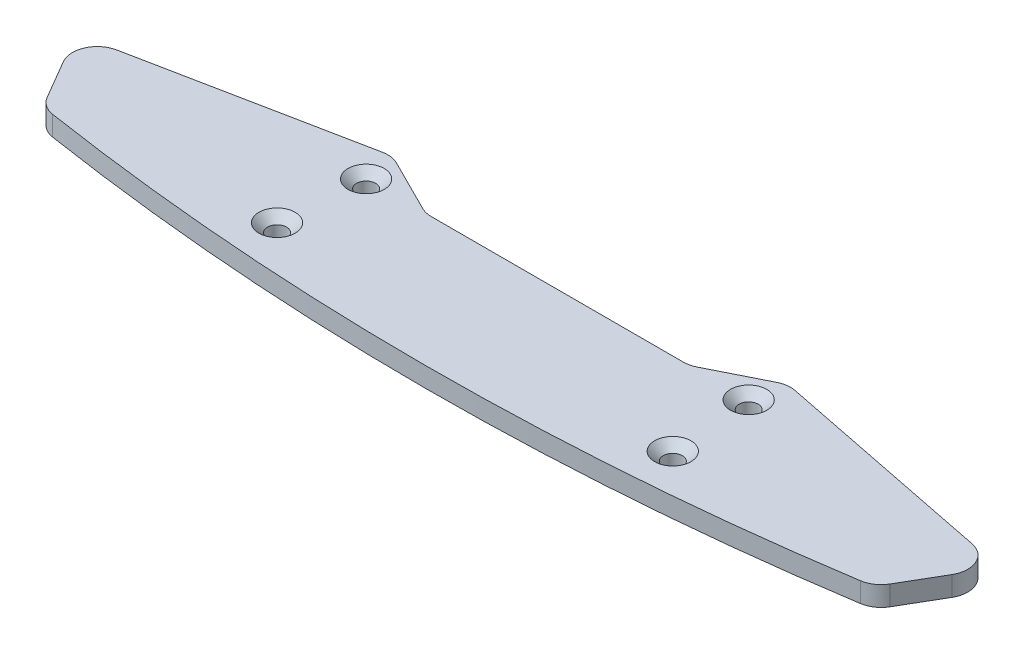
ISO-10303-21;
HEADER;
FILE_DESCRIPTION(('STEP AP214'),'2;1');
FILE_NAME('part.step','',(''),(''),'','','');
FILE_SCHEMA(('AUTOMOTIVE_DESIGN { 1 0 10303 214 1 1 1 1 }'));
ENDSEC;
DATA;
#1=APPLICATION_CONTEXT('core data for automotive mechanical design processes');
#2=APPLICATION_PROTOCOL_DEFINITION('international standard','automotive_design',2000,#1);
#3=PRODUCT_CONTEXT('',#1,'mechanical');
#4=PRODUCT('Part','Part','',(#3));
#5=PRODUCT_RELATED_PRODUCT_CATEGORY('part','',(#4));
#6=PRODUCT_DEFINITION_FORMATION('','',#4);
#7=PRODUCT_DEFINITION_CONTEXT('part definition',#1,'design');
#8=PRODUCT_DEFINITION('design','',#6,#7);
#9=PRODUCT_DEFINITION_SHAPE('','',#8);
#10=(LENGTH_UNIT() NAMED_UNIT(*) SI_UNIT(.MILLI.,.METRE.));
#11=(NAMED_UNIT(*) PLANE_ANGLE_UNIT() SI_UNIT($,.RADIAN.));
#12=(NAMED_UNIT(*) SI_UNIT($,.STERADIAN.) SOLID_ANGLE_UNIT());
#13=UNCERTAINTY_MEASURE_WITH_UNIT(LENGTH_MEASURE(1.E-05),#10,'distance_accuracy_value','');
#14=(GEOMETRIC_REPRESENTATION_CONTEXT(3) GLOBAL_UNCERTAINTY_ASSIGNED_CONTEXT((#13)) GLOBAL_UNIT_ASSIGNED_CONTEXT((#10,
#11,#12)) REPRESENTATION_CONTEXT('',''));
#15=CARTESIAN_POINT('',(0.,0.,0.));
#16=DIRECTION('',(0.,0.,1.));
#17=DIRECTION('',(1.,0.,0.));
#18=AXIS2_PLACEMENT_3D('',#15,#16,#17);
#19=CARTESIAN_POINT('',(0.,3.,0.));
#20=DIRECTION('',(0.,0.,1.));
#21=DIRECTION('',(1.,0.,0.));
#22=AXIS2_PLACEMENT_3D('',#19,#20,#21);
#23=PLANE('',#22);
#24=DIRECTION('',(-1.,0.,0.));
#25=VECTOR('',#24,1.);
#26=CARTESIAN_POINT('',(0.,3.,0.));
#27=LINE('',#26,#25);
#28=CARTESIAN_POINT('',(19.1147450843758,3.,0.));
#29=VERTEX_POINT('',#28);
#30=CARTESIAN_POINT('',(-19.1147450843758,3.,0.));
#31=VERTEX_POINT('',#30);
#32=EDGE_CURVE('E167',#29,#31,#27,.T.);
#33=ORIENTED_EDGE('',*,*,#32,.F.);
#34=DIRECTION('',(0.,-1.,0.));
#35=VECTOR('',#34,1.);
#36=CARTESIAN_POINT('',(19.1147450843758,0.,0.));
#37=LINE('',#36,#35);
#38=CARTESIAN_POINT('',(19.1147450843758,0.,0.));
#39=VERTEX_POINT('',#38);
#40=EDGE_CURVE('E152',#29,#39,#37,.T.);
#41=ORIENTED_EDGE('',*,*,#40,.T.);
#42=DIRECTION('',(-1.,0.,0.));
#43=VECTOR('',#42,1.);
#44=CARTESIAN_POINT('',(0.,0.,0.));
#45=LINE('',#44,#43);
#46=CARTESIAN_POINT('',(-19.1147450843758,0.,0.));
#47=VERTEX_POINT('',#46);
#48=EDGE_CURVE('E164',#39,#47,#45,.T.);
#49=ORIENTED_EDGE('',*,*,#48,.T.);
#50=DIRECTION('',(0.,-1.,0.));
#51=VECTOR('',#50,1.);
#52=CARTESIAN_POINT('',(-19.1147450843758,3.,0.));
#53=LINE('',#52,#51);
#54=EDGE_CURVE('E169',#47,#31,#53,.F.);
#55=ORIENTED_EDGE('',*,*,#54,.T.);
#56=EDGE_LOOP('',(#33,#41,#49,#55));
#57=FACE_BOUND('',#56,.T.);
#58=ADVANCED_FACE('F34',(#57),#23,.F.);
#59=CARTESIAN_POINT('',(0.,3.,-379.400000000001));
#60=DIRECTION('',(0.,-1.,0.));
#61=DIRECTION('',(0.,0.,-1.));
#62=AXIS2_PLACEMENT_3D('',#59,#60,#61);
#63=CYLINDRICAL_SURFACE('',#62,399.400000000001);
#64=CARTESIAN_POINT('',(0.,0.,-379.400000000001));
#65=DIRECTION('',(0.,1.,0.));
#66=DIRECTION('',(0.,0.,1.));
#67=AXIS2_PLACEMENT_3D('',#64,#65,#66);
#68=CIRCLE('',#67,399.400000000001);
#69=CARTESIAN_POINT('',(-61.2328777882055,0.,15.2782166243466));
#70=VERTEX_POINT('',#69);
#71=CARTESIAN_POINT('',(61.2328777882055,0.,15.2782166243468));
#72=VERTEX_POINT('',#71);
#73=EDGE_CURVE('E173',#70,#72,#68,.T.);
#74=ORIENTED_EDGE('',*,*,#73,.T.);
#75=DIRECTION('',(0.,-1.,0.));
#76=VECTOR('',#75,1.);
#77=CARTESIAN_POINT('',(61.2328777882055,3.,15.2782166243467));
#78=LINE('',#77,#76);
#79=CARTESIAN_POINT('',(61.2328777882055,3.,15.2782166243468));
#80=VERTEX_POINT('',#79);
#81=EDGE_CURVE('E231',#72,#80,#78,.F.);
#82=ORIENTED_EDGE('',*,*,#81,.T.);
#83=CARTESIAN_POINT('',(0.,3.,-379.400000000001));
#84=DIRECTION('',(0.,1.,0.));
#85=DIRECTION('',(0.,0.,1.));
#86=AXIS2_PLACEMENT_3D('',#83,#84,#85);
#87=CIRCLE('',#86,399.400000000001);
#88=CARTESIAN_POINT('',(-61.2328777882055,3.,15.2782166243466));
#89=VERTEX_POINT('',#88);
#90=EDGE_CURVE('E258',#89,#80,#87,.T.);
#91=ORIENTED_EDGE('',*,*,#90,.F.);
#92=DIRECTION('',(0.,-1.,0.));
#93=VECTOR('',#92,1.);
#94=CARTESIAN_POINT('',(-61.2328777882055,3.,15.2782166243468));
#95=LINE('',#94,#93);
#96=EDGE_CURVE('E228',#89,#70,#95,.T.);
#97=ORIENTED_EDGE('',*,*,#96,.T.);
#98=EDGE_LOOP('',(#74,#82,#91,#97));
#99=FACE_BOUND('',#98,.T.);
#100=ADVANCED_FACE('F342',(#99),#63,.T.);
#101=CARTESIAN_POINT('',(70.,3.,3.));
#102=DIRECTION('',(-0.863778900898433,0.,-0.503871025524086));
#103=DIRECTION('',(-0.503871025524087,0.,0.863778900898433));
#104=AXIS2_PLACEMENT_3D('',#101,#102,#103);
#105=PLANE('',#104);
#106=DIRECTION('',(0.503871025524087,0.,-0.863778900898433));
#107=VECTOR('',#106,1.);
#108=CARTESIAN_POINT('',(70.,0.,3.));
#109=LINE('',#108,#107);
#110=CARTESIAN_POINT('',(63.897128056395,0.,13.4620661890372));
#111=VERTEX_POINT('',#110);
#112=CARTESIAN_POINT('',(67.3536098778618,0.,7.53666878080844));
#113=VERTEX_POINT('',#112);
#114=EDGE_CURVE('E177',#111,#113,#109,.T.);
#115=ORIENTED_EDGE('',*,*,#114,.T.);
#116=DIRECTION('',(0.,-1.,0.));
#117=VECTOR('',#116,1.);
#118=CARTESIAN_POINT('',(67.3536098778618,3.,7.53666878080844));
#119=LINE('',#118,#117);
#120=CARTESIAN_POINT('',(67.3536098778618,3.,7.53666878080844));
#121=VERTEX_POINT('',#120);
#122=EDGE_CURVE('E49',#113,#121,#119,.F.);
#123=ORIENTED_EDGE('',*,*,#122,.T.);
#124=DIRECTION('',(0.503871025524087,0.,-0.863778900898433));
#125=VECTOR('',#124,1.);
#126=CARTESIAN_POINT('',(70.,3.,3.));
#127=LINE('',#126,#125);
#128=CARTESIAN_POINT('',(63.897128056395,3.,13.4620661890372));
#129=VERTEX_POINT('',#128);
#130=EDGE_CURVE('E256',#129,#121,#127,.T.);
#131=ORIENTED_EDGE('',*,*,#130,.F.);
#132=DIRECTION('',(0.,-1.,0.));
#133=VECTOR('',#132,1.);
#134=CARTESIAN_POINT('',(63.897128056395,3.,13.4620661890372));
#135=LINE('',#134,#133);
#136=EDGE_CURVE('E224',#129,#111,#135,.T.);
#137=ORIENTED_EDGE('',*,*,#136,.T.);
#138=EDGE_LOOP('',(#115,#123,#131,#137));
#139=FACE_BOUND('',#138,.T.);
#140=ADVANCED_FACE('F347',(#139),#105,.F.);
#141=CARTESIAN_POINT('',(30.,3.,-5.));
#142=DIRECTION('',(-0.196116135138184,0.,0.98058067569092));
#143=DIRECTION('',(0.98058067569092,0.,0.196116135138184));
#144=AXIS2_PLACEMENT_3D('',#141,#142,#143);
#145=PLANE('',#144);
#146=DIRECTION('',(-0.98058067569092,0.,-0.196116135138184));
#147=VECTOR('',#146,1.);
#148=CARTESIAN_POINT('',(30.,0.,-5.));
#149=LINE('',#148,#147);
#150=CARTESIAN_POINT('',(64.8498745062608,0.,1.96997490125216));
#151=VERTEX_POINT('',#150);
#152=CARTESIAN_POINT('',(31.2616681105075,0.,-4.7476663778985));
#153=VERTEX_POINT('',#152);
#154=EDGE_CURVE('E187',#151,#153,#149,.T.);
#155=ORIENTED_EDGE('',*,*,#154,.T.);
#156=DIRECTION('',(0.,-1.,0.));
#157=VECTOR('',#156,1.);
#158=CARTESIAN_POINT('',(31.2616681105075,3.,-4.7476663778985));
#159=LINE('',#158,#157);
#160=CARTESIAN_POINT('',(31.2616681105075,3.,-4.7476663778985));
#161=VERTEX_POINT('',#160);
#162=EDGE_CURVE('E211',#153,#161,#159,.F.);
#163=ORIENTED_EDGE('',*,*,#162,.T.);
#164=DIRECTION('',(-0.98058067569092,0.,-0.196116135138184));
#165=VECTOR('',#164,1.);
#166=CARTESIAN_POINT('',(30.,3.,-5.));
#167=LINE('',#166,#165);
#168=CARTESIAN_POINT('',(64.8498745062608,3.,1.96997490125216));
#169=VERTEX_POINT('',#168);
#170=EDGE_CURVE('E255',#169,#161,#167,.T.);
#171=ORIENTED_EDGE('',*,*,#170,.F.);
#172=DIRECTION('',(0.,-1.,0.));
#173=VECTOR('',#172,1.);
#174=CARTESIAN_POINT('',(64.8498745062608,3.,1.96997490125216));
#175=LINE('',#174,#173);
#176=EDGE_CURVE('E208',#169,#151,#175,.T.);
#177=ORIENTED_EDGE('',*,*,#176,.T.);
#178=EDGE_LOOP('',(#155,#163,#171,#177));
#179=FACE_BOUND('',#178,.T.);
#180=ADVANCED_FACE('F411',(#179),#145,.F.);
#181=CARTESIAN_POINT('',(20.,3.,0.));
#182=DIRECTION('',(0.447213595499958,0.,0.894427190999916));
#183=DIRECTION('',(0.894427190999916,0.,-0.447213595499958));
#184=AXIS2_PLACEMENT_3D('',#181,#182,#183);
#185=PLANE('',#184);
#186=DIRECTION('',(-0.894427190999916,0.,0.447213595499958));
#187=VECTOR('',#186,1.);
#188=CARTESIAN_POINT('',(20.,0.,0.));
#189=LINE('',#188,#187);
#190=CARTESIAN_POINT('',(28.8491816206145,0.,-4.42459081030723));
#191=VERTEX_POINT('',#190);
#192=CARTESIAN_POINT('',(20.7917960675006,0.,-0.395898033750313));
#193=VERTEX_POINT('',#192);
#194=EDGE_CURVE('E190',#191,#193,#189,.T.);
#195=ORIENTED_EDGE('',*,*,#194,.T.);
#196=DIRECTION('',(0.,-1.,0.));
#197=VECTOR('',#196,1.);
#198=CARTESIAN_POINT('',(20.7917960675006,3.,-0.395898033750313));
#199=LINE('',#198,#197);
#200=CARTESIAN_POINT('',(20.7917960675006,3.,-0.395898033750313));
#201=VERTEX_POINT('',#200);
#202=EDGE_CURVE('E153',#193,#201,#199,.F.);
#203=ORIENTED_EDGE('',*,*,#202,.T.);
#204=DIRECTION('',(-0.894427190999916,0.,0.447213595499958));
#205=VECTOR('',#204,1.);
#206=CARTESIAN_POINT('',(20.,3.,0.));
#207=LINE('',#206,#205);
#208=CARTESIAN_POINT('',(28.8491816206145,3.,-4.42459081030723));
#209=VERTEX_POINT('',#208);
#210=EDGE_CURVE('E183',#209,#201,#207,.T.);
#211=ORIENTED_EDGE('',*,*,#210,.F.);
#212=DIRECTION('',(0.,-1.,0.));
#213=VECTOR('',#212,1.);
#214=CARTESIAN_POINT('',(28.8491816206145,3.,-4.42459081030723));
#215=LINE('',#214,#213);
#216=EDGE_CURVE('E168',#209,#191,#215,.T.);
#217=ORIENTED_EDGE('',*,*,#216,.T.);
#218=EDGE_LOOP('',(#195,#203,#211,#217));
#219=FACE_BOUND('',#218,.T.);
#220=ADVANCED_FACE('F317',(#219),#185,.F.);
#221=CARTESIAN_POINT('',(0.,3.,-379.400000000001));
#222=DIRECTION('',(0.,1.,0.));
#223=DIRECTION('',(0.,0.,1.));
#224=AXIS2_PLACEMENT_3D('',#221,#222,#223);
#225=PLANE('',#224);
#226=CARTESIAN_POINT('',(-29.,3.,0.));
#227=DIRECTION('',(0.,1.,0.));
#228=DIRECTION('',(0.,0.,1.));
#229=AXIS2_PLACEMENT_3D('',#226,#227,#228);
#230=CIRCLE('',#229,2.75);
#231=CARTESIAN_POINT('',(-29.,3.,2.75));
#232=VERTEX_POINT('',#231);
#233=EDGE_CURVE('E309',#232,#232,#230,.T.);
#234=ORIENTED_EDGE('',*,*,#233,.F.);
#235=EDGE_LOOP('',(#234));
#236=FACE_BOUND('',#235,.T.);
#237=CARTESIAN_POINT('',(-30.,3.,12.5));
#238=DIRECTION('',(0.,1.,0.));
#239=DIRECTION('',(0.,0.,1.));
#240=AXIS2_PLACEMENT_3D('',#237,#238,#239);
#241=CIRCLE('',#240,2.75);
#242=CARTESIAN_POINT('',(-30.,3.,15.25));
#243=VERTEX_POINT('',#242);
#244=EDGE_CURVE('E300',#243,#243,#241,.T.);
#245=ORIENTED_EDGE('',*,*,#244,.F.);
#246=EDGE_LOOP('',(#245));
#247=FACE_BOUND('',#246,.T.);
#248=CARTESIAN_POINT('',(29.,3.,0.));
#249=DIRECTION('',(0.,1.,0.));
#250=DIRECTION('',(0.,0.,1.));
#251=AXIS2_PLACEMENT_3D('',#248,#249,#250);
#252=CIRCLE('',#251,2.75);
#253=CARTESIAN_POINT('',(29.,3.,2.75));
#254=VERTEX_POINT('',#253);
#255=EDGE_CURVE('E274',#254,#254,#252,.T.);
#256=ORIENTED_EDGE('',*,*,#255,.F.);
#257=EDGE_LOOP('',(#256));
#258=FACE_BOUND('',#257,.T.);
#259=CARTESIAN_POINT('',(30.,3.,12.5));
#260=DIRECTION('',(0.,1.,0.));
#261=DIRECTION('',(0.,0.,1.));
#262=AXIS2_PLACEMENT_3D('',#259,#260,#261);
#263=CIRCLE('',#262,2.75);
#264=CARTESIAN_POINT('',(30.,3.,15.25));
#265=VERTEX_POINT('',#264);
#266=EDGE_CURVE('E265',#265,#265,#263,.T.);
#267=ORIENTED_EDGE('',*,*,#266,.F.);
#268=EDGE_LOOP('',(#267));
#269=FACE_BOUND('',#268,.T.);
#270=ORIENTED_EDGE('',*,*,#170,.T.);
#271=CARTESIAN_POINT('',(30.5262326037393,3.,-1.07048884405755));
#272=DIRECTION('',(0.,1.,0.));
#273=DIRECTION('',(0.,0.,1.));
#274=AXIS2_PLACEMENT_3D('',#271,#272,#273);
#275=CIRCLE('',#274,3.75);
#276=EDGE_CURVE('E222',#161,#209,#275,.T.);
#277=ORIENTED_EDGE('',*,*,#276,.T.);
#278=ORIENTED_EDGE('',*,*,#210,.T.);
#279=CARTESIAN_POINT('',(19.1147450843758,3.,-3.75));
#280=DIRECTION('',(0.,1.,0.));
#281=DIRECTION('',(0.,0.,1.));
#282=AXIS2_PLACEMENT_3D('',#279,#280,#281);
#283=CIRCLE('',#282,3.75);
#284=EDGE_CURVE('E158',#201,#29,#283,.F.);
#285=ORIENTED_EDGE('',*,*,#284,.T.);
#286=ORIENTED_EDGE('',*,*,#32,.T.);
#287=CARTESIAN_POINT('',(-19.1147450843758,3.,-3.75));
#288=DIRECTION('',(0.,1.,0.));
#289=DIRECTION('',(0.,0.,1.));
#290=AXIS2_PLACEMENT_3D('',#287,#288,#289);
#291=CIRCLE('',#290,3.75);
#292=CARTESIAN_POINT('',(-20.7917960675006,3.,-0.395898033750315));
#293=VERTEX_POINT('',#292);
#294=EDGE_CURVE('E11',#31,#293,#291,.F.);
#295=ORIENTED_EDGE('',*,*,#294,.T.);
#296=DIRECTION('',(0.894427190999916,0.,0.447213595499958));
#297=VECTOR('',#296,1.);
#298=CARTESIAN_POINT('',(-20.,3.,0.));
#299=LINE('',#298,#297);
#300=CARTESIAN_POINT('',(-28.8491816206145,3.,-4.42459081030723));
#301=VERTEX_POINT('',#300);
#302=EDGE_CURVE('E281',#301,#293,#299,.T.);
#303=ORIENTED_EDGE('',*,*,#302,.F.);
#304=CARTESIAN_POINT('',(-30.5262326037393,3.,-1.07048884405755));
#305=DIRECTION('',(0.,1.,0.));
#306=DIRECTION('',(0.,0.,1.));
#307=AXIS2_PLACEMENT_3D('',#304,#305,#306);
#308=CIRCLE('',#307,3.75);
#309=CARTESIAN_POINT('',(-31.2616681105075,3.,-4.7476663778985));
#310=VERTEX_POINT('',#309);
#311=EDGE_CURVE('E215',#301,#310,#308,.T.);
#312=ORIENTED_EDGE('',*,*,#311,.T.);
#313=DIRECTION('',(0.98058067569092,0.,-0.196116135138184));
#314=VECTOR('',#313,1.);
#315=CARTESIAN_POINT('',(-30.,3.,-5.));
#316=LINE('',#315,#314);
#317=CARTESIAN_POINT('',(-64.8498745062608,3.,1.96997490125216));
#318=VERTEX_POINT('',#317);
#319=EDGE_CURVE('E290',#318,#310,#316,.T.);
#320=ORIENTED_EDGE('',*,*,#319,.F.);
#321=CARTESIAN_POINT('',(-64.1144389994926,3.,5.64715243509311));
#322=DIRECTION('',(0.,1.,0.));
#323=DIRECTION('',(0.,0.,1.));
#324=AXIS2_PLACEMENT_3D('',#321,#322,#323);
#325=CIRCLE('',#324,3.75);
#326=CARTESIAN_POINT('',(-67.3536098778618,3.,7.53666878080844));
#327=VERTEX_POINT('',#326);
#328=EDGE_CURVE('E217',#318,#327,#325,.T.);
#329=ORIENTED_EDGE('',*,*,#328,.T.);
#330=DIRECTION('',(-0.503871025524087,0.,-0.863778900898433));
#331=VECTOR('',#330,1.);
#332=CARTESIAN_POINT('',(-70.,3.,3.));
#333=LINE('',#332,#331);
#334=CARTESIAN_POINT('',(-63.8971280563949,3.,13.4620661890372));
#335=VERTEX_POINT('',#334);
#336=EDGE_CURVE('E277',#335,#327,#333,.T.);
#337=ORIENTED_EDGE('',*,*,#336,.F.);
#338=CARTESIAN_POINT('',(-60.6579571780258,3.,11.5725498433219));
#339=DIRECTION('',(0.,1.,0.));
#340=DIRECTION('',(0.,0.,1.));
#341=AXIS2_PLACEMENT_3D('',#338,#339,#340);
#342=CIRCLE('',#341,3.75);
#343=EDGE_CURVE('E213',#335,#89,#342,.T.);
#344=ORIENTED_EDGE('',*,*,#343,.T.);
#345=ORIENTED_EDGE('',*,*,#90,.T.);
#346=CARTESIAN_POINT('',(60.6579571780258,3.,11.5725498433218));
#347=DIRECTION('',(0.,1.,0.));
#348=DIRECTION('',(0.,0.,1.));
#349=AXIS2_PLACEMENT_3D('',#346,#347,#348);
#350=CIRCLE('',#349,3.75);
#351=EDGE_CURVE('E56',#80,#129,#350,.T.);
#352=ORIENTED_EDGE('',*,*,#351,.T.);
#353=ORIENTED_EDGE('',*,*,#130,.T.);
#354=CARTESIAN_POINT('',(64.1144389994926,3.,5.64715243509311));
#355=DIRECTION('',(0.,1.,0.));
#356=DIRECTION('',(0.,0.,1.));
#357=AXIS2_PLACEMENT_3D('',#354,#355,#356);
#358=CIRCLE('',#357,3.75);
#359=EDGE_CURVE('E220',#121,#169,#358,.T.);
#360=ORIENTED_EDGE('',*,*,#359,.T.);
#361=EDGE_LOOP('',(#270,#277,#278,#285,#286,#295,#303,#312,#320,#329,#337,#344,#345,#352,#353,#360));
#362=FACE_BOUND('',#361,.T.);
#363=ADVANCED_FACE('F249',(#236,#247,#258,#269,#362),#225,.T.);
#364=CARTESIAN_POINT('',(0.,0.,-379.400000000001));
#365=DIRECTION('',(0.,1.,0.));
#366=DIRECTION('',(0.,0.,1.));
#367=AXIS2_PLACEMENT_3D('',#364,#365,#366);
#368=PLANE('',#367);
#369=CARTESIAN_POINT('',(-29.,0.,0.));
#370=DIRECTION('',(0.,1.,0.));
#371=DIRECTION('',(0.,0.,1.));
#372=AXIS2_PLACEMENT_3D('',#369,#370,#371);
#373=CIRCLE('',#372,1.45);
#374=CARTESIAN_POINT('',(-29.,0.,1.45));
#375=VERTEX_POINT('',#374);
#376=EDGE_CURVE('E303',#375,#375,#373,.T.);
#377=ORIENTED_EDGE('',*,*,#376,.T.);
#378=EDGE_LOOP('',(#377));
#379=FACE_BOUND('',#378,.T.);
#380=CARTESIAN_POINT('',(-30.,0.,12.5));
#381=DIRECTION('',(0.,1.,0.));
#382=DIRECTION('',(0.,0.,1.));
#383=AXIS2_PLACEMENT_3D('',#380,#381,#382);
#384=CIRCLE('',#383,1.45);
#385=CARTESIAN_POINT('',(-30.,0.,13.95));
#386=VERTEX_POINT('',#385);
#387=EDGE_CURVE('E287',#386,#386,#384,.T.);
#388=ORIENTED_EDGE('',*,*,#387,.T.);
#389=EDGE_LOOP('',(#388));
#390=FACE_BOUND('',#389,.T.);
#391=CARTESIAN_POINT('',(29.,0.,0.));
#392=DIRECTION('',(0.,1.,0.));
#393=DIRECTION('',(0.,0.,1.));
#394=AXIS2_PLACEMENT_3D('',#391,#392,#393);
#395=CIRCLE('',#394,1.45);
#396=CARTESIAN_POINT('',(29.,0.,1.45));
#397=VERTEX_POINT('',#396);
#398=EDGE_CURVE('E268',#397,#397,#395,.T.);
#399=ORIENTED_EDGE('',*,*,#398,.T.);
#400=EDGE_LOOP('',(#399));
#401=FACE_BOUND('',#400,.T.);
#402=CARTESIAN_POINT('',(30.,0.,12.5));
#403=DIRECTION('',(0.,1.,0.));
#404=DIRECTION('',(0.,0.,1.));
#405=AXIS2_PLACEMENT_3D('',#402,#403,#404);
#406=CIRCLE('',#405,1.45);
#407=CARTESIAN_POINT('',(30.,0.,13.95));
#408=VERTEX_POINT('',#407);
#409=EDGE_CURVE('E174',#408,#408,#406,.T.);
#410=ORIENTED_EDGE('',*,*,#409,.T.);
#411=EDGE_LOOP('',(#410));
#412=FACE_BOUND('',#411,.T.);
#413=ORIENTED_EDGE('',*,*,#194,.F.);
#414=CARTESIAN_POINT('',(30.5262326037393,0.,-1.07048884405755));
#415=DIRECTION('',(0.,1.,0.));
#416=DIRECTION('',(0.,0.,1.));
#417=AXIS2_PLACEMENT_3D('',#414,#415,#416);
#418=CIRCLE('',#417,3.75);
#419=EDGE_CURVE('E206',#191,#153,#418,.F.);
#420=ORIENTED_EDGE('',*,*,#419,.T.);
#421=ORIENTED_EDGE('',*,*,#154,.F.);
#422=CARTESIAN_POINT('',(64.1144389994926,0.,5.64715243509311));
#423=DIRECTION('',(0.,1.,0.));
#424=DIRECTION('',(0.,0.,1.));
#425=AXIS2_PLACEMENT_3D('',#422,#423,#424);
#426=CIRCLE('',#425,3.75);
#427=EDGE_CURVE('E204',#151,#113,#426,.F.);
#428=ORIENTED_EDGE('',*,*,#427,.T.);
#429=ORIENTED_EDGE('',*,*,#114,.F.);
#430=CARTESIAN_POINT('',(60.6579571780258,0.,11.5725498433218));
#431=DIRECTION('',(0.,1.,0.));
#432=DIRECTION('',(0.,0.,1.));
#433=AXIS2_PLACEMENT_3D('',#430,#431,#432);
#434=CIRCLE('',#433,3.75);
#435=EDGE_CURVE('E202',#111,#72,#434,.F.);
#436=ORIENTED_EDGE('',*,*,#435,.T.);
#437=ORIENTED_EDGE('',*,*,#73,.F.);
#438=CARTESIAN_POINT('',(-60.6579571780258,0.,11.5725498433219));
#439=DIRECTION('',(0.,1.,0.));
#440=DIRECTION('',(0.,0.,1.));
#441=AXIS2_PLACEMENT_3D('',#438,#439,#440);
#442=CIRCLE('',#441,3.75);
#443=CARTESIAN_POINT('',(-63.8971280563949,0.,13.4620661890372));
#444=VERTEX_POINT('',#443);
#445=EDGE_CURVE('E196',#70,#444,#442,.F.);
#446=ORIENTED_EDGE('',*,*,#445,.T.);
#447=DIRECTION('',(-0.503871025524087,0.,-0.863778900898433));
#448=VECTOR('',#447,1.);
#449=CARTESIAN_POINT('',(-70.,0.,3.));
#450=LINE('',#449,#448);
#451=CARTESIAN_POINT('',(-67.3536098778618,0.,7.53666878080844));
#452=VERTEX_POINT('',#451);
#453=EDGE_CURVE('E278',#444,#452,#450,.T.);
#454=ORIENTED_EDGE('',*,*,#453,.T.);
#455=CARTESIAN_POINT('',(-64.1144389994926,0.,5.64715243509311));
#456=DIRECTION('',(0.,1.,0.));
#457=DIRECTION('',(0.,0.,1.));
#458=AXIS2_PLACEMENT_3D('',#455,#456,#457);
#459=CIRCLE('',#458,3.75);
#460=CARTESIAN_POINT('',(-64.8498745062608,0.,1.96997490125216));
#461=VERTEX_POINT('',#460);
#462=EDGE_CURVE('E200',#452,#461,#459,.F.);
#463=ORIENTED_EDGE('',*,*,#462,.T.);
#464=DIRECTION('',(0.98058067569092,0.,-0.196116135138184));
#465=VECTOR('',#464,1.);
#466=CARTESIAN_POINT('',(-30.,0.,-5.));
#467=LINE('',#466,#465);
#468=CARTESIAN_POINT('',(-31.2616681105075,0.,-4.7476663778985));
#469=VERTEX_POINT('',#468);
#470=EDGE_CURVE('E282',#461,#469,#467,.T.);
#471=ORIENTED_EDGE('',*,*,#470,.T.);
#472=CARTESIAN_POINT('',(-30.5262326037393,0.,-1.07048884405755));
#473=DIRECTION('',(0.,1.,0.));
#474=DIRECTION('',(0.,0.,1.));
#475=AXIS2_PLACEMENT_3D('',#472,#473,#474);
#476=CIRCLE('',#475,3.75);
#477=CARTESIAN_POINT('',(-28.8491816206145,0.,-4.42459081030723));
#478=VERTEX_POINT('',#477);
#479=EDGE_CURVE('E198',#469,#478,#476,.F.);
#480=ORIENTED_EDGE('',*,*,#479,.T.);
#481=DIRECTION('',(0.894427190999916,0.,0.447213595499958));
#482=VECTOR('',#481,1.);
#483=CARTESIAN_POINT('',(-20.,0.,0.));
#484=LINE('',#483,#482);
#485=CARTESIAN_POINT('',(-20.7917960675006,0.,-0.395898033750315));
#486=VERTEX_POINT('',#485);
#487=EDGE_CURVE('E285',#478,#486,#484,.T.);
#488=ORIENTED_EDGE('',*,*,#487,.T.);
#489=CARTESIAN_POINT('',(-19.1147450843758,0.,-3.75));
#490=DIRECTION('',(0.,1.,0.));
#491=DIRECTION('',(0.,0.,1.));
#492=AXIS2_PLACEMENT_3D('',#489,#490,#491);
#493=CIRCLE('',#492,3.75);
#494=EDGE_CURVE('E42',#486,#47,#493,.T.);
#495=ORIENTED_EDGE('',*,*,#494,.T.);
#496=ORIENTED_EDGE('',*,*,#48,.F.);
#497=CARTESIAN_POINT('',(19.1147450843758,0.,-3.75));
#498=DIRECTION('',(0.,1.,0.));
#499=DIRECTION('',(0.,0.,1.));
#500=AXIS2_PLACEMENT_3D('',#497,#498,#499);
#501=CIRCLE('',#500,3.75);
#502=EDGE_CURVE('E148',#39,#193,#501,.T.);
#503=ORIENTED_EDGE('',*,*,#502,.T.);
#504=EDGE_LOOP('',(#413,#420,#421,#428,#429,#436,#437,#446,#454,#463,#471,#480,#488,#495,#496,#503));
#505=FACE_BOUND('',#504,.T.);
#506=ADVANCED_FACE('F171',(#379,#390,#401,#412,#505),#368,.F.);
#507=CARTESIAN_POINT('',(30.,3.,12.5));
#508=DIRECTION('',(0.,1.,0.));
#509=DIRECTION('',(0.,0.,1.));
#510=AXIS2_PLACEMENT_3D('',#507,#508,#509);
#511=CYLINDRICAL_SURFACE('',#510,1.44999999999999);
#512=ORIENTED_EDGE('',*,*,#409,.F.);
#513=EDGE_LOOP('',(#512));
#514=FACE_BOUND('',#513,.T.);
#515=CARTESIAN_POINT('',(30.,1.69999999999999,12.5));
#516=DIRECTION('',(0.,1.,0.));
#517=DIRECTION('',(0.,0.,1.));
#518=AXIS2_PLACEMENT_3D('',#515,#516,#517);
#519=CIRCLE('',#518,1.44999999999999);
#520=CARTESIAN_POINT('',(30.,1.69999999999999,13.95));
#521=VERTEX_POINT('',#520);
#522=EDGE_CURVE('E180',#521,#521,#519,.T.);
#523=ORIENTED_EDGE('',*,*,#522,.T.);
#524=EDGE_LOOP('',(#523));
#525=FACE_BOUND('',#524,.T.);
#526=ADVANCED_FACE('F328',(#514,#525),#511,.F.);
#527=CARTESIAN_POINT('',(30.,3.,12.5));
#528=DIRECTION('',(0.,1.,0.));
#529=DIRECTION('',(0.,0.,1.));
#530=AXIS2_PLACEMENT_3D('',#527,#528,#529);
#531=CONICAL_SURFACE('',#530,2.75,0.78539816339745);
#532=ORIENTED_EDGE('',*,*,#522,.F.);
#533=EDGE_LOOP('',(#532));
#534=FACE_BOUND('',#533,.T.);
#535=ORIENTED_EDGE('',*,*,#266,.T.);
#536=EDGE_LOOP('',(#535));
#537=FACE_BOUND('',#536,.T.);
#538=ADVANCED_FACE('F325',(#534,#537),#531,.F.);
#539=CARTESIAN_POINT('',(29.,3.,0.));
#540=DIRECTION('',(0.,1.,0.));
#541=DIRECTION('',(0.,0.,1.));
#542=AXIS2_PLACEMENT_3D('',#539,#540,#541);
#543=CYLINDRICAL_SURFACE('',#542,1.44999999999999);
#544=ORIENTED_EDGE('',*,*,#398,.F.);
#545=EDGE_LOOP('',(#544));
#546=FACE_BOUND('',#545,.T.);
#547=CARTESIAN_POINT('',(29.,1.69999999999999,0.));
#548=DIRECTION('',(0.,1.,0.));
#549=DIRECTION('',(0.,0.,1.));
#550=AXIS2_PLACEMENT_3D('',#547,#548,#549);
#551=CIRCLE('',#550,1.44999999999999);
#552=CARTESIAN_POINT('',(29.,1.69999999999999,1.44999999999999));
#553=VERTEX_POINT('',#552);
#554=EDGE_CURVE('E271',#553,#553,#551,.T.);
#555=ORIENTED_EDGE('',*,*,#554,.T.);
#556=EDGE_LOOP('',(#555));
#557=FACE_BOUND('',#556,.T.);
#558=ADVANCED_FACE('F327',(#546,#557),#543,.F.);
#559=CARTESIAN_POINT('',(29.,3.,0.));
#560=DIRECTION('',(0.,1.,0.));
#561=DIRECTION('',(0.,0.,1.));
#562=AXIS2_PLACEMENT_3D('',#559,#560,#561);
#563=CONICAL_SURFACE('',#562,2.75,0.78539816339745);
#564=ORIENTED_EDGE('',*,*,#554,.F.);
#565=EDGE_LOOP('',(#564));
#566=FACE_BOUND('',#565,.T.);
#567=ORIENTED_EDGE('',*,*,#255,.T.);
#568=EDGE_LOOP('',(#567));
#569=FACE_BOUND('',#568,.T.);
#570=ADVANCED_FACE('F335',(#566,#569),#563,.F.);
#571=CARTESIAN_POINT('',(-20.,3.,0.));
#572=DIRECTION('',(0.447213595499958,0.,-0.894427190999916));
#573=DIRECTION('',(-0.894427190999916,0.,-0.447213595499958));
#574=AXIS2_PLACEMENT_3D('',#571,#572,#573);
#575=PLANE('',#574);
#576=ORIENTED_EDGE('',*,*,#487,.F.);
#577=DIRECTION('',(0.,-1.,0.));
#578=VECTOR('',#577,1.);
#579=CARTESIAN_POINT('',(-28.8491816206145,3.,-4.42459081030723));
#580=LINE('',#579,#578);
#581=EDGE_CURVE('E159',#478,#301,#580,.F.);
#582=ORIENTED_EDGE('',*,*,#581,.T.);
#583=ORIENTED_EDGE('',*,*,#302,.T.);
#584=DIRECTION('',(0.,-1.,0.));
#585=VECTOR('',#584,1.);
#586=CARTESIAN_POINT('',(-20.7917960675006,3.,-0.395898033750315));
#587=LINE('',#586,#585);
#588=EDGE_CURVE('E243',#293,#486,#587,.T.);
#589=ORIENTED_EDGE('',*,*,#588,.T.);
#590=EDGE_LOOP('',(#576,#582,#583,#589));
#591=FACE_BOUND('',#590,.T.);
#592=ADVANCED_FACE('F385',(#591),#575,.T.);
#593=CARTESIAN_POINT('',(-30.,3.,-5.));
#594=DIRECTION('',(-0.196116135138184,0.,-0.98058067569092));
#595=DIRECTION('',(-0.98058067569092,0.,0.196116135138184));
#596=AXIS2_PLACEMENT_3D('',#593,#594,#595);
#597=PLANE('',#596);
#598=ORIENTED_EDGE('',*,*,#470,.F.);
#599=DIRECTION('',(0.,-1.,0.));
#600=VECTOR('',#599,1.);
#601=CARTESIAN_POINT('',(-64.8498745062608,3.,1.96997490125216));
#602=LINE('',#601,#600);
#603=EDGE_CURVE('E241',#461,#318,#602,.F.);
#604=ORIENTED_EDGE('',*,*,#603,.T.);
#605=ORIENTED_EDGE('',*,*,#319,.T.);
#606=DIRECTION('',(0.,-1.,0.));
#607=VECTOR('',#606,1.);
#608=CARTESIAN_POINT('',(-31.2616681105075,3.,-4.7476663778985));
#609=LINE('',#608,#607);
#610=EDGE_CURVE('E238',#310,#469,#609,.T.);
#611=ORIENTED_EDGE('',*,*,#610,.T.);
#612=EDGE_LOOP('',(#598,#604,#605,#611));
#613=FACE_BOUND('',#612,.T.);
#614=ADVANCED_FACE('F392',(#613),#597,.T.);
#615=CARTESIAN_POINT('',(-70.,3.,3.));
#616=DIRECTION('',(-0.863778900898433,0.,0.503871025524086));
#617=DIRECTION('',(0.503871025524087,0.,0.863778900898433));
#618=AXIS2_PLACEMENT_3D('',#615,#616,#617);
#619=PLANE('',#618);
#620=ORIENTED_EDGE('',*,*,#336,.T.);
#621=DIRECTION('',(0.,-1.,0.));
#622=VECTOR('',#621,1.);
#623=CARTESIAN_POINT('',(-67.3536098778618,3.,7.53666878080844));
#624=LINE('',#623,#622);
#625=EDGE_CURVE('E235',#327,#452,#624,.T.);
#626=ORIENTED_EDGE('',*,*,#625,.T.);
#627=ORIENTED_EDGE('',*,*,#453,.F.);
#628=DIRECTION('',(0.,1.,0.));
#629=VECTOR('',#628,1.);
#630=CARTESIAN_POINT('',(-63.8971280563949,3.,13.4620661890372));
#631=LINE('',#630,#629);
#632=EDGE_CURVE('E233',#444,#335,#631,.T.);
#633=ORIENTED_EDGE('',*,*,#632,.T.);
#634=EDGE_LOOP('',(#620,#626,#627,#633));
#635=FACE_BOUND('',#634,.T.);
#636=ADVANCED_FACE('F398',(#635),#619,.T.);
#637=CARTESIAN_POINT('',(-30.,3.,12.5));
#638=DIRECTION('',(0.,1.,0.));
#639=DIRECTION('',(0.,0.,1.));
#640=AXIS2_PLACEMENT_3D('',#637,#638,#639);
#641=CYLINDRICAL_SURFACE('',#640,1.44999999999999);
#642=ORIENTED_EDGE('',*,*,#387,.F.);
#643=EDGE_LOOP('',(#642));
#644=FACE_BOUND('',#643,.T.);
#645=CARTESIAN_POINT('',(-30.,1.69999999999999,12.5));
#646=DIRECTION('',(0.,1.,0.));
#647=DIRECTION('',(0.,0.,1.));
#648=AXIS2_PLACEMENT_3D('',#645,#646,#647);
#649=CIRCLE('',#648,1.44999999999999);
#650=CARTESIAN_POINT('',(-30.,1.69999999999999,13.95));
#651=VERTEX_POINT('',#650);
#652=EDGE_CURVE('E297',#651,#651,#649,.T.);
#653=ORIENTED_EDGE('',*,*,#652,.T.);
#654=EDGE_LOOP('',(#653));
#655=FACE_BOUND('',#654,.T.);
#656=ADVANCED_FACE('F476',(#644,#655),#641,.F.);
#657=CARTESIAN_POINT('',(-30.,3.,12.5));
#658=DIRECTION('',(0.,1.,0.));
#659=DIRECTION('',(0.,0.,1.));
#660=AXIS2_PLACEMENT_3D('',#657,#658,#659);
#661=CONICAL_SURFACE('',#660,2.75,0.785398163397449);
#662=ORIENTED_EDGE('',*,*,#652,.F.);
#663=EDGE_LOOP('',(#662));
#664=FACE_BOUND('',#663,.T.);
#665=ORIENTED_EDGE('',*,*,#244,.T.);
#666=EDGE_LOOP('',(#665));
#667=FACE_BOUND('',#666,.T.);
#668=ADVANCED_FACE('F540',(#664,#667),#661,.F.);
#669=CARTESIAN_POINT('',(-29.,3.,0.));
#670=DIRECTION('',(0.,1.,0.));
#671=DIRECTION('',(0.,0.,1.));
#672=AXIS2_PLACEMENT_3D('',#669,#670,#671);
#673=CYLINDRICAL_SURFACE('',#672,1.44999999999999);
#674=ORIENTED_EDGE('',*,*,#376,.F.);
#675=EDGE_LOOP('',(#674));
#676=FACE_BOUND('',#675,.T.);
#677=CARTESIAN_POINT('',(-29.,1.69999999999999,0.));
#678=DIRECTION('',(0.,1.,0.));
#679=DIRECTION('',(0.,0.,1.));
#680=AXIS2_PLACEMENT_3D('',#677,#678,#679);
#681=CIRCLE('',#680,1.44999999999999);
#682=CARTESIAN_POINT('',(-29.,1.69999999999999,1.44999999999999));
#683=VERTEX_POINT('',#682);
#684=EDGE_CURVE('E306',#683,#683,#681,.T.);
#685=ORIENTED_EDGE('',*,*,#684,.T.);
#686=EDGE_LOOP('',(#685));
#687=FACE_BOUND('',#686,.T.);
#688=ADVANCED_FACE('F533',(#676,#687),#673,.F.);
#689=CARTESIAN_POINT('',(-29.,3.,0.));
#690=DIRECTION('',(0.,1.,0.));
#691=DIRECTION('',(0.,0.,1.));
#692=AXIS2_PLACEMENT_3D('',#689,#690,#691);
#693=CONICAL_SURFACE('',#692,2.75,0.785398163397449);
#694=ORIENTED_EDGE('',*,*,#684,.F.);
#695=EDGE_LOOP('',(#694));
#696=FACE_BOUND('',#695,.T.);
#697=ORIENTED_EDGE('',*,*,#233,.T.);
#698=EDGE_LOOP('',(#697));
#699=FACE_BOUND('',#698,.T.);
#700=ADVANCED_FACE('F313',(#696,#699),#693,.F.);
#701=CARTESIAN_POINT('',(19.1147450843758,3.,-3.75));
#702=DIRECTION('',(0.,1.,0.));
#703=DIRECTION('',(0.,0.,1.));
#704=AXIS2_PLACEMENT_3D('',#701,#702,#703);
#705=CYLINDRICAL_SURFACE('',#704,3.75);
#706=ORIENTED_EDGE('',*,*,#284,.F.);
#707=ORIENTED_EDGE('',*,*,#202,.F.);
#708=ORIENTED_EDGE('',*,*,#502,.F.);
#709=ORIENTED_EDGE('',*,*,#40,.F.);
#710=EDGE_LOOP('',(#706,#707,#708,#709));
#711=FACE_BOUND('',#710,.T.);
#712=ADVANCED_FACE('F151',(#711),#705,.F.);
#713=CARTESIAN_POINT('',(30.5262326037393,3.,-1.07048884405755));
#714=DIRECTION('',(0.,-1.,0.));
#715=DIRECTION('',(0.,0.,-1.));
#716=AXIS2_PLACEMENT_3D('',#713,#714,#715);
#717=CYLINDRICAL_SURFACE('',#716,3.75);
#718=ORIENTED_EDGE('',*,*,#276,.F.);
#719=ORIENTED_EDGE('',*,*,#162,.F.);
#720=ORIENTED_EDGE('',*,*,#419,.F.);
#721=ORIENTED_EDGE('',*,*,#216,.F.);
#722=EDGE_LOOP('',(#718,#719,#720,#721));
#723=FACE_BOUND('',#722,.T.);
#724=ADVANCED_FACE('F354',(#723),#717,.T.);
#725=CARTESIAN_POINT('',(64.1144389994926,3.,5.64715243509311));
#726=DIRECTION('',(0.,-1.,0.));
#727=DIRECTION('',(0.,0.,-1.));
#728=AXIS2_PLACEMENT_3D('',#725,#726,#727);
#729=CYLINDRICAL_SURFACE('',#728,3.75);
#730=ORIENTED_EDGE('',*,*,#359,.F.);
#731=ORIENTED_EDGE('',*,*,#122,.F.);
#732=ORIENTED_EDGE('',*,*,#427,.F.);
#733=ORIENTED_EDGE('',*,*,#176,.F.);
#734=EDGE_LOOP('',(#730,#731,#732,#733));
#735=FACE_BOUND('',#734,.T.);
#736=ADVANCED_FACE('F357',(#735),#729,.T.);
#737=CARTESIAN_POINT('',(60.6579571780258,3.,11.5725498433218));
#738=DIRECTION('',(0.,-1.,0.));
#739=DIRECTION('',(0.,0.,-1.));
#740=AXIS2_PLACEMENT_3D('',#737,#738,#739);
#741=CYLINDRICAL_SURFACE('',#740,3.75);
#742=ORIENTED_EDGE('',*,*,#351,.F.);
#743=ORIENTED_EDGE('',*,*,#81,.F.);
#744=ORIENTED_EDGE('',*,*,#435,.F.);
#745=ORIENTED_EDGE('',*,*,#136,.F.);
#746=EDGE_LOOP('',(#742,#743,#744,#745));
#747=FACE_BOUND('',#746,.T.);
#748=ADVANCED_FACE('F361',(#747),#741,.T.);
#749=CARTESIAN_POINT('',(-64.1144389994926,3.,5.64715243509311));
#750=DIRECTION('',(0.,-1.,0.));
#751=DIRECTION('',(0.,0.,-1.));
#752=AXIS2_PLACEMENT_3D('',#749,#750,#751);
#753=CYLINDRICAL_SURFACE('',#752,3.75);
#754=ORIENTED_EDGE('',*,*,#328,.F.);
#755=ORIENTED_EDGE('',*,*,#603,.F.);
#756=ORIENTED_EDGE('',*,*,#462,.F.);
#757=ORIENTED_EDGE('',*,*,#625,.F.);
#758=EDGE_LOOP('',(#754,#755,#756,#757));
#759=FACE_BOUND('',#758,.T.);
#760=ADVANCED_FACE('F365',(#759),#753,.T.);
#761=CARTESIAN_POINT('',(-30.5262326037393,3.,-1.07048884405755));
#762=DIRECTION('',(0.,-1.,0.));
#763=DIRECTION('',(0.,0.,-1.));
#764=AXIS2_PLACEMENT_3D('',#761,#762,#763);
#765=CYLINDRICAL_SURFACE('',#764,3.75);
#766=ORIENTED_EDGE('',*,*,#311,.F.);
#767=ORIENTED_EDGE('',*,*,#581,.F.);
#768=ORIENTED_EDGE('',*,*,#479,.F.);
#769=ORIENTED_EDGE('',*,*,#610,.F.);
#770=EDGE_LOOP('',(#766,#767,#768,#769));
#771=FACE_BOUND('',#770,.T.);
#772=ADVANCED_FACE('F369',(#771),#765,.T.);
#773=CARTESIAN_POINT('',(-19.1147450843758,3.,-3.75));
#774=DIRECTION('',(0.,-1.,0.));
#775=DIRECTION('',(0.,0.,-1.));
#776=AXIS2_PLACEMENT_3D('',#773,#774,#775);
#777=CYLINDRICAL_SURFACE('',#776,3.75);
#778=ORIENTED_EDGE('',*,*,#294,.F.);
#779=ORIENTED_EDGE('',*,*,#54,.F.);
#780=ORIENTED_EDGE('',*,*,#494,.F.);
#781=ORIENTED_EDGE('',*,*,#588,.F.);
#782=EDGE_LOOP('',(#778,#779,#780,#781));
#783=FACE_BOUND('',#782,.T.);
#784=ADVANCED_FACE('F372',(#783),#777,.F.);
#785=CARTESIAN_POINT('',(-60.6579571780258,3.,11.5725498433219));
#786=DIRECTION('',(0.,-1.,0.));
#787=DIRECTION('',(0.,0.,-1.));
#788=AXIS2_PLACEMENT_3D('',#785,#786,#787);
#789=CYLINDRICAL_SURFACE('',#788,3.75);
#790=ORIENTED_EDGE('',*,*,#343,.F.);
#791=ORIENTED_EDGE('',*,*,#632,.F.);
#792=ORIENTED_EDGE('',*,*,#445,.F.);
#793=ORIENTED_EDGE('',*,*,#96,.F.);
#794=EDGE_LOOP('',(#790,#791,#792,#793));
#795=FACE_BOUND('',#794,.T.);
#796=ADVANCED_FACE('F36',(#795),#789,.T.);
#797=CLOSED_SHELL('',(#58,#100,#140,#180,#220,#363,#506,#526,#538,#558,#570,#592,#614,#636,#656,
#668,#688,#700,#712,#724,#736,#748,#760,#772,#784,#796));
#798=MANIFOLD_SOLID_BREP('B2',#797);
#799=ADVANCED_BREP_SHAPE_REPRESENTATION('',(#18,#798),#14);
#800=SHAPE_DEFINITION_REPRESENTATION(#9,#799);
ENDSEC;
END-ISO-10303-21;
